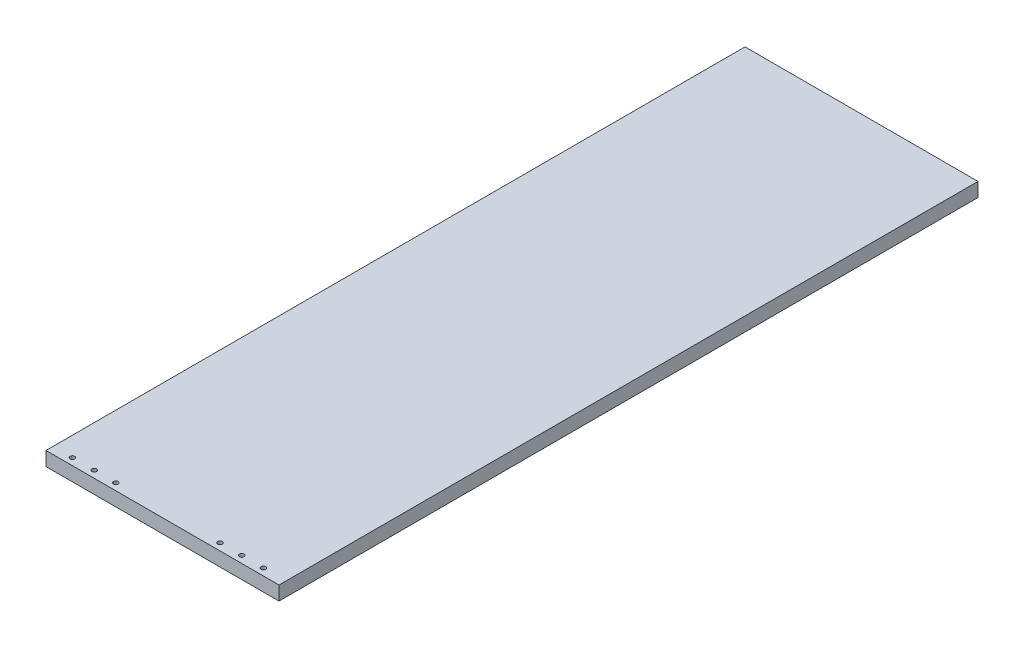
ISO-10303-21;
HEADER;
FILE_DESCRIPTION(('STEP AP214'),'2;1');
FILE_NAME('part.step','',(''),(''),'','','');
FILE_SCHEMA(('AUTOMOTIVE_DESIGN { 1 0 10303 214 1 1 1 1 }'));
ENDSEC;
DATA;
#1=APPLICATION_CONTEXT('core data for automotive mechanical design processes');
#2=APPLICATION_PROTOCOL_DEFINITION('international standard','automotive_design',2000,#1);
#3=PRODUCT_CONTEXT('',#1,'mechanical');
#4=PRODUCT('Part','Part','',(#3));
#5=PRODUCT_RELATED_PRODUCT_CATEGORY('part','',(#4));
#6=PRODUCT_DEFINITION_FORMATION('','',#4);
#7=PRODUCT_DEFINITION_CONTEXT('part definition',#1,'design');
#8=PRODUCT_DEFINITION('design','',#6,#7);
#9=PRODUCT_DEFINITION_SHAPE('','',#8);
#10=(LENGTH_UNIT() NAMED_UNIT(*) SI_UNIT(.MILLI.,.METRE.));
#11=(NAMED_UNIT(*) PLANE_ANGLE_UNIT() SI_UNIT($,.RADIAN.));
#12=(NAMED_UNIT(*) SI_UNIT($,.STERADIAN.) SOLID_ANGLE_UNIT());
#13=UNCERTAINTY_MEASURE_WITH_UNIT(LENGTH_MEASURE(1.E-05),#10,'distance_accuracy_value','');
#14=(GEOMETRIC_REPRESENTATION_CONTEXT(3) GLOBAL_UNCERTAINTY_ASSIGNED_CONTEXT((#13)) GLOBAL_UNIT_ASSIGNED_CONTEXT((#10,
#11,#12)) REPRESENTATION_CONTEXT('',''));
#15=CARTESIAN_POINT('',(0.,0.,0.));
#16=DIRECTION('',(0.,0.,1.));
#17=DIRECTION('',(1.,0.,0.));
#18=AXIS2_PLACEMENT_3D('',#15,#16,#17);
#19=CARTESIAN_POINT('',(0.,18.,0.));
#20=DIRECTION('',(1.,0.,0.));
#21=DIRECTION('',(0.,0.,-1.));
#22=AXIS2_PLACEMENT_3D('',#19,#20,#21);
#23=PLANE('',#22);
#24=DIRECTION('',(0.,0.,1.));
#25=VECTOR('',#24,1.);
#26=CARTESIAN_POINT('',(0.,0.,0.));
#27=LINE('',#26,#25);
#28=CARTESIAN_POINT('',(0.,0.,-900.));
#29=VERTEX_POINT('',#28);
#30=CARTESIAN_POINT('',(0.,0.,0.));
#31=VERTEX_POINT('',#30);
#32=EDGE_CURVE('E99',#29,#31,#27,.T.);
#33=ORIENTED_EDGE('',*,*,#32,.T.);
#34=DIRECTION('',(0.,-1.,0.));
#35=VECTOR('',#34,1.);
#36=CARTESIAN_POINT('',(0.,18.,0.));
#37=LINE('',#36,#35);
#38=CARTESIAN_POINT('',(0.,18.,0.));
#39=VERTEX_POINT('',#38);
#40=EDGE_CURVE('E11',#39,#31,#37,.T.);
#41=ORIENTED_EDGE('',*,*,#40,.F.);
#42=DIRECTION('',(0.,0.,1.));
#43=VECTOR('',#42,1.);
#44=CARTESIAN_POINT('',(0.,18.,0.));
#45=LINE('',#44,#43);
#46=CARTESIAN_POINT('',(0.,18.,-900.));
#47=VERTEX_POINT('',#46);
#48=EDGE_CURVE('E87',#47,#39,#45,.T.);
#49=ORIENTED_EDGE('',*,*,#48,.F.);
#50=DIRECTION('',(0.,-1.,0.));
#51=VECTOR('',#50,1.);
#52=CARTESIAN_POINT('',(0.,18.,-900.));
#53=LINE('',#52,#51);
#54=EDGE_CURVE('E95',#47,#29,#53,.T.);
#55=ORIENTED_EDGE('',*,*,#54,.T.);
#56=EDGE_LOOP('',(#33,#41,#49,#55));
#57=FACE_BOUND('',#56,.T.);
#58=ADVANCED_FACE('F36',(#57),#23,.F.);
#59=CARTESIAN_POINT('',(0.,18.,0.));
#60=DIRECTION('',(0.,0.,-1.));
#61=DIRECTION('',(-1.,0.,0.));
#62=AXIS2_PLACEMENT_3D('',#59,#60,#61);
#63=PLANE('',#62);
#64=DIRECTION('',(1.,0.,0.));
#65=VECTOR('',#64,1.);
#66=CARTESIAN_POINT('',(0.,0.,0.));
#67=LINE('',#66,#65);
#68=CARTESIAN_POINT('',(300.,0.,0.));
#69=VERTEX_POINT('',#68);
#70=EDGE_CURVE('E91',#31,#69,#67,.T.);
#71=ORIENTED_EDGE('',*,*,#70,.T.);
#72=DIRECTION('',(0.,-1.,0.));
#73=VECTOR('',#72,1.);
#74=CARTESIAN_POINT('',(300.,18.,0.));
#75=LINE('',#74,#73);
#76=CARTESIAN_POINT('',(300.,18.,0.));
#77=VERTEX_POINT('',#76);
#78=EDGE_CURVE('E44',#77,#69,#75,.T.);
#79=ORIENTED_EDGE('',*,*,#78,.F.);
#80=DIRECTION('',(1.,0.,0.));
#81=VECTOR('',#80,1.);
#82=CARTESIAN_POINT('',(0.,18.,0.));
#83=LINE('',#82,#81);
#84=EDGE_CURVE('E82',#39,#77,#83,.T.);
#85=ORIENTED_EDGE('',*,*,#84,.F.);
#86=ORIENTED_EDGE('',*,*,#40,.T.);
#87=EDGE_LOOP('',(#71,#79,#85,#86));
#88=FACE_BOUND('',#87,.T.);
#89=ADVANCED_FACE('F90',(#88),#63,.F.);
#90=CARTESIAN_POINT('',(300.,18.,0.));
#91=DIRECTION('',(-1.,0.,0.));
#92=DIRECTION('',(0.,0.,1.));
#93=AXIS2_PLACEMENT_3D('',#90,#91,#92);
#94=PLANE('',#93);
#95=DIRECTION('',(0.,0.,-1.));
#96=VECTOR('',#95,1.);
#97=CARTESIAN_POINT('',(300.,0.,0.));
#98=LINE('',#97,#96);
#99=CARTESIAN_POINT('',(300.,0.,-900.));
#100=VERTEX_POINT('',#99);
#101=EDGE_CURVE('E69',#69,#100,#98,.T.);
#102=ORIENTED_EDGE('',*,*,#101,.T.);
#103=DIRECTION('',(0.,-1.,0.));
#104=VECTOR('',#103,1.);
#105=CARTESIAN_POINT('',(300.,18.,-900.));
#106=LINE('',#105,#104);
#107=CARTESIAN_POINT('',(300.,18.,-900.));
#108=VERTEX_POINT('',#107);
#109=EDGE_CURVE('E92',#108,#100,#106,.T.);
#110=ORIENTED_EDGE('',*,*,#109,.F.);
#111=DIRECTION('',(0.,0.,-1.));
#112=VECTOR('',#111,1.);
#113=CARTESIAN_POINT('',(300.,18.,0.));
#114=LINE('',#113,#112);
#115=EDGE_CURVE('E85',#77,#108,#114,.T.);
#116=ORIENTED_EDGE('',*,*,#115,.F.);
#117=ORIENTED_EDGE('',*,*,#78,.T.);
#118=EDGE_LOOP('',(#102,#110,#116,#117));
#119=FACE_BOUND('',#118,.T.);
#120=ADVANCED_FACE('F93',(#119),#94,.F.);
#121=CARTESIAN_POINT('',(0.,18.,-900.));
#122=DIRECTION('',(0.,0.,1.));
#123=DIRECTION('',(1.,0.,0.));
#124=AXIS2_PLACEMENT_3D('',#121,#122,#123);
#125=PLANE('',#124);
#126=DIRECTION('',(-1.,0.,0.));
#127=VECTOR('',#126,1.);
#128=CARTESIAN_POINT('',(0.,0.,-900.));
#129=LINE('',#128,#127);
#130=EDGE_CURVE('E75',#100,#29,#129,.T.);
#131=ORIENTED_EDGE('',*,*,#130,.T.);
#132=ORIENTED_EDGE('',*,*,#54,.F.);
#133=DIRECTION('',(-1.,0.,0.));
#134=VECTOR('',#133,1.);
#135=CARTESIAN_POINT('',(0.,18.,-900.));
#136=LINE('',#135,#134);
#137=EDGE_CURVE('E52',#108,#47,#136,.T.);
#138=ORIENTED_EDGE('',*,*,#137,.F.);
#139=ORIENTED_EDGE('',*,*,#109,.T.);
#140=EDGE_LOOP('',(#131,#132,#138,#139));
#141=FACE_BOUND('',#140,.T.);
#142=ADVANCED_FACE('F107',(#141),#125,.F.);
#143=CARTESIAN_POINT('',(0.,18.,0.));
#144=DIRECTION('',(0.,-1.,0.));
#145=DIRECTION('',(0.,0.,-1.));
#146=AXIS2_PLACEMENT_3D('',#143,#144,#145);
#147=PLANE('',#146);
#148=CARTESIAN_POINT('',(25.,18.,-9.));
#149=DIRECTION('',(0.,1.,0.));
#150=DIRECTION('',(0.,0.,1.));
#151=AXIS2_PLACEMENT_3D('',#148,#149,#150);
#152=CIRCLE('',#151,3.00000000000001);
#153=CARTESIAN_POINT('',(25.,18.,-5.99999999999999));
#154=VERTEX_POINT('',#153);
#155=EDGE_CURVE('E143',#154,#154,#152,.T.);
#156=ORIENTED_EDGE('',*,*,#155,.F.);
#157=EDGE_LOOP('',(#156));
#158=FACE_BOUND('',#157,.T.);
#159=CARTESIAN_POINT('',(53.,18.,-9.));
#160=DIRECTION('',(0.,1.,0.));
#161=DIRECTION('',(0.,0.,1.));
#162=AXIS2_PLACEMENT_3D('',#159,#160,#161);
#163=CIRCLE('',#162,3.00000000000001);
#164=CARTESIAN_POINT('',(53.,18.,-5.99999999999999));
#165=VERTEX_POINT('',#164);
#166=EDGE_CURVE('E137',#165,#165,#163,.T.);
#167=ORIENTED_EDGE('',*,*,#166,.F.);
#168=EDGE_LOOP('',(#167));
#169=FACE_BOUND('',#168,.T.);
#170=CARTESIAN_POINT('',(81.,18.,-9.));
#171=DIRECTION('',(0.,1.,0.));
#172=DIRECTION('',(0.,0.,1.));
#173=AXIS2_PLACEMENT_3D('',#170,#171,#172);
#174=CIRCLE('',#173,3.00000000000001);
#175=CARTESIAN_POINT('',(81.,18.,-5.99999999999999));
#176=VERTEX_POINT('',#175);
#177=EDGE_CURVE('E131',#176,#176,#174,.T.);
#178=ORIENTED_EDGE('',*,*,#177,.F.);
#179=EDGE_LOOP('',(#178));
#180=FACE_BOUND('',#179,.T.);
#181=CARTESIAN_POINT('',(215.,18.,-9.));
#182=DIRECTION('',(0.,1.,0.));
#183=DIRECTION('',(0.,0.,1.));
#184=AXIS2_PLACEMENT_3D('',#181,#182,#183);
#185=CIRCLE('',#184,2.99999999999999);
#186=CARTESIAN_POINT('',(215.,18.,-6.00000000000001));
#187=VERTEX_POINT('',#186);
#188=EDGE_CURVE('E125',#187,#187,#185,.T.);
#189=ORIENTED_EDGE('',*,*,#188,.F.);
#190=EDGE_LOOP('',(#189));
#191=FACE_BOUND('',#190,.T.);
#192=CARTESIAN_POINT('',(243.,18.,-9.));
#193=DIRECTION('',(0.,1.,0.));
#194=DIRECTION('',(0.,0.,1.));
#195=AXIS2_PLACEMENT_3D('',#192,#193,#194);
#196=CIRCLE('',#195,2.99999999999999);
#197=CARTESIAN_POINT('',(243.,18.,-6.00000000000001));
#198=VERTEX_POINT('',#197);
#199=EDGE_CURVE('E119',#198,#198,#196,.T.);
#200=ORIENTED_EDGE('',*,*,#199,.F.);
#201=EDGE_LOOP('',(#200));
#202=FACE_BOUND('',#201,.T.);
#203=CARTESIAN_POINT('',(271.,18.,-9.));
#204=DIRECTION('',(0.,1.,0.));
#205=DIRECTION('',(0.,0.,1.));
#206=AXIS2_PLACEMENT_3D('',#203,#204,#205);
#207=CIRCLE('',#206,2.99999999999994);
#208=CARTESIAN_POINT('',(271.,18.,-6.00000000000006));
#209=VERTEX_POINT('',#208);
#210=EDGE_CURVE('E113',#209,#209,#207,.T.);
#211=ORIENTED_EDGE('',*,*,#210,.F.);
#212=EDGE_LOOP('',(#211));
#213=FACE_BOUND('',#212,.T.);
#214=ORIENTED_EDGE('',*,*,#48,.T.);
#215=ORIENTED_EDGE('',*,*,#84,.T.);
#216=ORIENTED_EDGE('',*,*,#115,.T.);
#217=ORIENTED_EDGE('',*,*,#137,.T.);
#218=EDGE_LOOP('',(#214,#215,#216,#217));
#219=FACE_BOUND('',#218,.T.);
#220=ADVANCED_FACE('F83',(#158,#169,#180,#191,#202,#213,#219),#147,.F.);
#221=CARTESIAN_POINT('',(0.,0.,0.));
#222=DIRECTION('',(0.,-1.,0.));
#223=DIRECTION('',(0.,0.,-1.));
#224=AXIS2_PLACEMENT_3D('',#221,#222,#223);
#225=PLANE('',#224);
#226=ORIENTED_EDGE('',*,*,#32,.F.);
#227=ORIENTED_EDGE('',*,*,#130,.F.);
#228=ORIENTED_EDGE('',*,*,#101,.F.);
#229=ORIENTED_EDGE('',*,*,#70,.F.);
#230=EDGE_LOOP('',(#226,#227,#228,#229));
#231=FACE_BOUND('',#230,.T.);
#232=ADVANCED_FACE('F110',(#231),#225,.T.);
#233=CARTESIAN_POINT('',(271.,9.,-9.));
#234=DIRECTION('',(0.,1.,0.));
#235=DIRECTION('',(0.,0.,1.));
#236=AXIS2_PLACEMENT_3D('',#233,#234,#235);
#237=CYLINDRICAL_SURFACE('',#236,2.99999999999994);
#238=CARTESIAN_POINT('',(271.,9.,-9.));
#239=DIRECTION('',(0.,1.,0.));
#240=DIRECTION('',(0.,0.,1.));
#241=AXIS2_PLACEMENT_3D('',#238,#239,#240);
#242=CIRCLE('',#241,2.99999999999994);
#243=CARTESIAN_POINT('',(271.,9.,-6.00000000000006));
#244=VERTEX_POINT('',#243);
#245=EDGE_CURVE('E116',#244,#244,#242,.T.);
#246=ORIENTED_EDGE('',*,*,#245,.F.);
#247=EDGE_LOOP('',(#246));
#248=FACE_BOUND('',#247,.T.);
#249=ORIENTED_EDGE('',*,*,#210,.T.);
#250=EDGE_LOOP('',(#249));
#251=FACE_BOUND('',#250,.T.);
#252=ADVANCED_FACE('F171',(#248,#251),#237,.F.);
#253=CARTESIAN_POINT('',(271.,9.,-9.));
#254=DIRECTION('',(0.,1.,0.));
#255=DIRECTION('',(0.,0.,1.));
#256=AXIS2_PLACEMENT_3D('',#253,#254,#255);
#257=PLANE('',#256);
#258=ORIENTED_EDGE('',*,*,#245,.T.);
#259=EDGE_LOOP('',(#258));
#260=FACE_BOUND('',#259,.T.);
#261=ADVANCED_FACE('F173',(#260),#257,.T.);
#262=CARTESIAN_POINT('',(243.,9.,-9.));
#263=DIRECTION('',(0.,1.,0.));
#264=DIRECTION('',(0.,0.,1.));
#265=AXIS2_PLACEMENT_3D('',#262,#263,#264);
#266=CYLINDRICAL_SURFACE('',#265,2.99999999999999);
#267=CARTESIAN_POINT('',(243.,9.,-9.));
#268=DIRECTION('',(0.,1.,0.));
#269=DIRECTION('',(0.,0.,1.));
#270=AXIS2_PLACEMENT_3D('',#267,#268,#269);
#271=CIRCLE('',#270,2.99999999999999);
#272=CARTESIAN_POINT('',(243.,9.,-6.00000000000001));
#273=VERTEX_POINT('',#272);
#274=EDGE_CURVE('E122',#273,#273,#271,.T.);
#275=ORIENTED_EDGE('',*,*,#274,.F.);
#276=EDGE_LOOP('',(#275));
#277=FACE_BOUND('',#276,.T.);
#278=ORIENTED_EDGE('',*,*,#199,.T.);
#279=EDGE_LOOP('',(#278));
#280=FACE_BOUND('',#279,.T.);
#281=ADVANCED_FACE('F180',(#277,#280),#266,.F.);
#282=CARTESIAN_POINT('',(243.,9.,-9.));
#283=DIRECTION('',(0.,1.,0.));
#284=DIRECTION('',(0.,0.,1.));
#285=AXIS2_PLACEMENT_3D('',#282,#283,#284);
#286=PLANE('',#285);
#287=ORIENTED_EDGE('',*,*,#274,.T.);
#288=EDGE_LOOP('',(#287));
#289=FACE_BOUND('',#288,.T.);
#290=ADVANCED_FACE('F228',(#289),#286,.T.);
#291=CARTESIAN_POINT('',(215.,9.,-9.));
#292=DIRECTION('',(0.,1.,0.));
#293=DIRECTION('',(0.,0.,1.));
#294=AXIS2_PLACEMENT_3D('',#291,#292,#293);
#295=CYLINDRICAL_SURFACE('',#294,2.99999999999999);
#296=CARTESIAN_POINT('',(215.,9.,-9.));
#297=DIRECTION('',(0.,1.,0.));
#298=DIRECTION('',(0.,0.,1.));
#299=AXIS2_PLACEMENT_3D('',#296,#297,#298);
#300=CIRCLE('',#299,2.99999999999999);
#301=CARTESIAN_POINT('',(215.,9.,-6.00000000000001));
#302=VERTEX_POINT('',#301);
#303=EDGE_CURVE('E128',#302,#302,#300,.T.);
#304=ORIENTED_EDGE('',*,*,#303,.F.);
#305=EDGE_LOOP('',(#304));
#306=FACE_BOUND('',#305,.T.);
#307=ORIENTED_EDGE('',*,*,#188,.T.);
#308=EDGE_LOOP('',(#307));
#309=FACE_BOUND('',#308,.T.);
#310=ADVANCED_FACE('F237',(#306,#309),#295,.F.);
#311=CARTESIAN_POINT('',(215.,9.,-9.));
#312=DIRECTION('',(0.,1.,0.));
#313=DIRECTION('',(0.,0.,1.));
#314=AXIS2_PLACEMENT_3D('',#311,#312,#313);
#315=PLANE('',#314);
#316=ORIENTED_EDGE('',*,*,#303,.T.);
#317=EDGE_LOOP('',(#316));
#318=FACE_BOUND('',#317,.T.);
#319=ADVANCED_FACE('F246',(#318),#315,.T.);
#320=CARTESIAN_POINT('',(81.,9.,-9.));
#321=DIRECTION('',(0.,1.,0.));
#322=DIRECTION('',(0.,0.,1.));
#323=AXIS2_PLACEMENT_3D('',#320,#321,#322);
#324=CYLINDRICAL_SURFACE('',#323,3.00000000000001);
#325=CARTESIAN_POINT('',(81.,9.,-9.));
#326=DIRECTION('',(0.,1.,0.));
#327=DIRECTION('',(0.,0.,1.));
#328=AXIS2_PLACEMENT_3D('',#325,#326,#327);
#329=CIRCLE('',#328,3.00000000000001);
#330=CARTESIAN_POINT('',(81.,9.,-5.99999999999999));
#331=VERTEX_POINT('',#330);
#332=EDGE_CURVE('E134',#331,#331,#329,.T.);
#333=ORIENTED_EDGE('',*,*,#332,.F.);
#334=EDGE_LOOP('',(#333));
#335=FACE_BOUND('',#334,.T.);
#336=ORIENTED_EDGE('',*,*,#177,.T.);
#337=EDGE_LOOP('',(#336));
#338=FACE_BOUND('',#337,.T.);
#339=ADVANCED_FACE('F255',(#335,#338),#324,.F.);
#340=CARTESIAN_POINT('',(81.,9.,-9.));
#341=DIRECTION('',(0.,1.,0.));
#342=DIRECTION('',(0.,0.,1.));
#343=AXIS2_PLACEMENT_3D('',#340,#341,#342);
#344=PLANE('',#343);
#345=ORIENTED_EDGE('',*,*,#332,.T.);
#346=EDGE_LOOP('',(#345));
#347=FACE_BOUND('',#346,.T.);
#348=ADVANCED_FACE('F264',(#347),#344,.T.);
#349=CARTESIAN_POINT('',(53.,9.,-9.));
#350=DIRECTION('',(0.,1.,0.));
#351=DIRECTION('',(0.,0.,1.));
#352=AXIS2_PLACEMENT_3D('',#349,#350,#351);
#353=CYLINDRICAL_SURFACE('',#352,3.00000000000001);
#354=CARTESIAN_POINT('',(53.,9.,-9.));
#355=DIRECTION('',(0.,1.,0.));
#356=DIRECTION('',(0.,0.,1.));
#357=AXIS2_PLACEMENT_3D('',#354,#355,#356);
#358=CIRCLE('',#357,3.00000000000001);
#359=CARTESIAN_POINT('',(53.,9.,-5.99999999999999));
#360=VERTEX_POINT('',#359);
#361=EDGE_CURVE('E140',#360,#360,#358,.T.);
#362=ORIENTED_EDGE('',*,*,#361,.F.);
#363=EDGE_LOOP('',(#362));
#364=FACE_BOUND('',#363,.T.);
#365=ORIENTED_EDGE('',*,*,#166,.T.);
#366=EDGE_LOOP('',(#365));
#367=FACE_BOUND('',#366,.T.);
#368=ADVANCED_FACE('F273',(#364,#367),#353,.F.);
#369=CARTESIAN_POINT('',(53.,9.,-9.));
#370=DIRECTION('',(0.,1.,0.));
#371=DIRECTION('',(0.,0.,1.));
#372=AXIS2_PLACEMENT_3D('',#369,#370,#371);
#373=PLANE('',#372);
#374=ORIENTED_EDGE('',*,*,#361,.T.);
#375=EDGE_LOOP('',(#374));
#376=FACE_BOUND('',#375,.T.);
#377=ADVANCED_FACE('F154',(#376),#373,.T.);
#378=CARTESIAN_POINT('',(25.,9.,-9.));
#379=DIRECTION('',(0.,1.,0.));
#380=DIRECTION('',(0.,0.,1.));
#381=AXIS2_PLACEMENT_3D('',#378,#379,#380);
#382=CYLINDRICAL_SURFACE('',#381,3.00000000000001);
#383=CARTESIAN_POINT('',(25.,9.,-9.));
#384=DIRECTION('',(0.,1.,0.));
#385=DIRECTION('',(0.,0.,1.));
#386=AXIS2_PLACEMENT_3D('',#383,#384,#385);
#387=CIRCLE('',#386,3.00000000000001);
#388=CARTESIAN_POINT('',(25.,9.,-5.99999999999999));
#389=VERTEX_POINT('',#388);
#390=EDGE_CURVE('E102',#389,#389,#387,.T.);
#391=ORIENTED_EDGE('',*,*,#390,.F.);
#392=EDGE_LOOP('',(#391));
#393=FACE_BOUND('',#392,.T.);
#394=ORIENTED_EDGE('',*,*,#155,.T.);
#395=EDGE_LOOP('',(#394));
#396=FACE_BOUND('',#395,.T.);
#397=ADVANCED_FACE('F151',(#393,#396),#382,.F.);
#398=CARTESIAN_POINT('',(25.,9.,-9.));
#399=DIRECTION('',(0.,1.,0.));
#400=DIRECTION('',(0.,0.,1.));
#401=AXIS2_PLACEMENT_3D('',#398,#399,#400);
#402=PLANE('',#401);
#403=ORIENTED_EDGE('',*,*,#390,.T.);
#404=EDGE_LOOP('',(#403));
#405=FACE_BOUND('',#404,.T.);
#406=ADVANCED_FACE('F149',(#405),#402,.T.);
#407=CLOSED_SHELL('',(#58,#89,#120,#142,#220,#232,#252,#261,#281,#290,#310,#319,#339,#348,#368,
#377,#397,#406));
#408=MANIFOLD_SOLID_BREP('B2',#407);
#409=ADVANCED_BREP_SHAPE_REPRESENTATION('',(#18,#408),#14);
#410=SHAPE_DEFINITION_REPRESENTATION(#9,#409);
ENDSEC;
END-ISO-10303-21;
